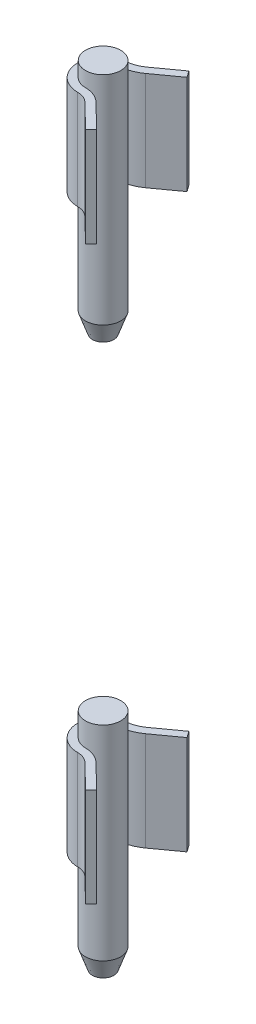
ISO-10303-21;
HEADER;
FILE_DESCRIPTION(('STEP AP214'),'2;1');
FILE_NAME('part.step','',(''),(''),'','','');
FILE_SCHEMA(('AUTOMOTIVE_DESIGN { 1 0 10303 214 1 1 1 1 }'));
ENDSEC;
DATA;
#1=APPLICATION_CONTEXT('core data for automotive mechanical design processes');
#2=APPLICATION_PROTOCOL_DEFINITION('international standard','automotive_design',2000,#1);
#3=PRODUCT_CONTEXT('',#1,'mechanical');
#4=PRODUCT('Part','Part','',(#3));
#5=PRODUCT_RELATED_PRODUCT_CATEGORY('part','',(#4));
#6=PRODUCT_DEFINITION_FORMATION('','',#4);
#7=PRODUCT_DEFINITION_CONTEXT('part definition',#1,'design');
#8=PRODUCT_DEFINITION('design','',#6,#7);
#9=PRODUCT_DEFINITION_SHAPE('','',#8);
#10=(LENGTH_UNIT() NAMED_UNIT(*) SI_UNIT(.MILLI.,.METRE.));
#11=(NAMED_UNIT(*) PLANE_ANGLE_UNIT() SI_UNIT($,.RADIAN.));
#12=(NAMED_UNIT(*) SI_UNIT($,.STERADIAN.) SOLID_ANGLE_UNIT());
#13=UNCERTAINTY_MEASURE_WITH_UNIT(LENGTH_MEASURE(1.E-05),#10,'distance_accuracy_value','');
#14=(GEOMETRIC_REPRESENTATION_CONTEXT(3) GLOBAL_UNCERTAINTY_ASSIGNED_CONTEXT((#13)) GLOBAL_UNIT_ASSIGNED_CONTEXT((#10,
#11,#12)) REPRESENTATION_CONTEXT('',''));
#15=CARTESIAN_POINT('',(0.,0.,0.));
#16=DIRECTION('',(0.,0.,1.));
#17=DIRECTION('',(1.,0.,0.));
#18=AXIS2_PLACEMENT_3D('',#15,#16,#17);
#19=CARTESIAN_POINT('',(0.,201.1,0.));
#20=DIRECTION('',(0.,-1.,0.));
#21=DIRECTION('',(0.,0.,-1.));
#22=AXIS2_PLACEMENT_3D('',#19,#20,#21);
#23=CYLINDRICAL_SURFACE('',#22,4.5);
#24=DIRECTION('',(0.,-1.,0.));
#25=VECTOR('',#24,1.);
#26=CARTESIAN_POINT('',(-0.420073756125089,197.3,-4.48035021392468));
#27=LINE('',#26,#25);
#28=CARTESIAN_POINT('',(-0.42007375612509,197.3,-4.48035021392468));
#29=VERTEX_POINT('',#28);
#30=CARTESIAN_POINT('',(-0.42007375612509,172.,-4.48035021392468));
#31=VERTEX_POINT('',#30);
#32=EDGE_CURVE('E69',#29,#31,#27,.T.);
#33=ORIENTED_EDGE('',*,*,#32,.F.);
#34=CARTESIAN_POINT('',(0.,197.3,0.));
#35=DIRECTION('',(0.,1.,0.));
#36=DIRECTION('',(0.,0.,-1.));
#37=AXIS2_PLACEMENT_3D('',#34,#35,#36);
#38=CIRCLE('',#37,4.5);
#39=CARTESIAN_POINT('',(0.,197.3,4.5));
#40=VERTEX_POINT('',#39);
#41=EDGE_CURVE('E64',#29,#40,#38,.T.);
#42=ORIENTED_EDGE('',*,*,#41,.T.);
#43=DIRECTION('',(0.,-1.,0.));
#44=VECTOR('',#43,1.);
#45=CARTESIAN_POINT('',(0.,197.3,4.5));
#46=LINE('',#45,#44);
#47=CARTESIAN_POINT('',(0.,172.,4.5));
#48=VERTEX_POINT('',#47);
#49=EDGE_CURVE('E225',#40,#48,#46,.T.);
#50=ORIENTED_EDGE('',*,*,#49,.T.);
#51=CARTESIAN_POINT('',(0.,172.,0.));
#52=DIRECTION('',(0.,1.,0.));
#53=DIRECTION('',(0.,0.,-1.));
#54=AXIS2_PLACEMENT_3D('',#51,#52,#53);
#55=CIRCLE('',#54,4.5);
#56=EDGE_CURVE('E217',#31,#48,#55,.T.);
#57=ORIENTED_EDGE('',*,*,#56,.F.);
#58=EDGE_LOOP('',(#33,#42,#50,#57));
#59=FACE_BOUND('',#58,.T.);
#60=CARTESIAN_POINT('',(0.,201.1,0.));
#61=DIRECTION('',(0.,1.,0.));
#62=DIRECTION('',(0.,0.,1.));
#63=AXIS2_PLACEMENT_3D('',#60,#61,#62);
#64=CIRCLE('',#63,4.5);
#65=CARTESIAN_POINT('',(0.,201.1,4.5));
#66=VERTEX_POINT('',#65);
#67=EDGE_CURVE('E12',#66,#66,#64,.T.);
#68=ORIENTED_EDGE('',*,*,#67,.F.);
#69=EDGE_LOOP('',(#68));
#70=FACE_BOUND('',#69,.T.);
#71=CARTESIAN_POINT('',(0.,145.7,0.));
#72=DIRECTION('',(0.,1.,0.));
#73=DIRECTION('',(0.,0.,1.));
#74=AXIS2_PLACEMENT_3D('',#71,#72,#73);
#75=CIRCLE('',#74,4.5);
#76=CARTESIAN_POINT('',(0.,145.7,4.5));
#77=VERTEX_POINT('',#76);
#78=EDGE_CURVE('E458',#77,#77,#75,.T.);
#79=ORIENTED_EDGE('',*,*,#78,.T.);
#80=EDGE_LOOP('',(#79));
#81=FACE_BOUND('',#80,.T.);
#82=ADVANCED_FACE('F50',(#59,#70,#81),#23,.T.);
#83=CARTESIAN_POINT('',(0.,201.1,0.));
#84=DIRECTION('',(0.,1.,0.));
#85=DIRECTION('',(0.,0.,1.));
#86=AXIS2_PLACEMENT_3D('',#83,#84,#85);
#87=PLANE('',#86);
#88=ORIENTED_EDGE('',*,*,#67,.T.);
#89=EDGE_LOOP('',(#88));
#90=FACE_BOUND('',#89,.T.);
#91=ADVANCED_FACE('F285',(#90),#87,.T.);
#92=CARTESIAN_POINT('',(9.27353574898046,197.3,13.7598368488019));
#93=DIRECTION('',(0.716874010789402,0.,0.697202734256483));
#94=DIRECTION('',(0.697202734256483,0.,-0.716874010789402));
#95=AXIS2_PLACEMENT_3D('',#92,#93,#94);
#96=PLANE('',#95);
#97=DIRECTION('',(-0.697202734256483,0.,0.716874010789402));
#98=VECTOR('',#97,1.);
#99=CARTESIAN_POINT('',(9.27353574898046,172.,13.7598368488019));
#100=LINE('',#99,#98);
#101=CARTESIAN_POINT('',(10.6679412174934,172.,12.3260888272231));
#102=VERTEX_POINT('',#101);
#103=CARTESIAN_POINT('',(9.27353574898046,172.,13.7598368488019));
#104=VERTEX_POINT('',#103);
#105=EDGE_CURVE('E193',#102,#104,#100,.T.);
#106=ORIENTED_EDGE('',*,*,#105,.F.);
#107=DIRECTION('',(0.,-1.,0.));
#108=VECTOR('',#107,1.);
#109=CARTESIAN_POINT('',(10.6679412174934,197.3,12.3260888272231));
#110=LINE('',#109,#108);
#111=CARTESIAN_POINT('',(10.6679412174934,197.3,12.3260888272231));
#112=VERTEX_POINT('',#111);
#113=EDGE_CURVE('E57',#112,#102,#110,.T.);
#114=ORIENTED_EDGE('',*,*,#113,.F.);
#115=DIRECTION('',(-0.697202734256483,0.,0.716874010789402));
#116=VECTOR('',#115,1.);
#117=CARTESIAN_POINT('',(9.27353574898046,197.3,13.7598368488019));
#118=LINE('',#117,#116);
#119=CARTESIAN_POINT('',(9.27353574898046,197.3,13.7598368488019));
#120=VERTEX_POINT('',#119);
#121=EDGE_CURVE('E153',#112,#120,#118,.T.);
#122=ORIENTED_EDGE('',*,*,#121,.T.);
#123=DIRECTION('',(0.,-1.,0.));
#124=VECTOR('',#123,1.);
#125=CARTESIAN_POINT('',(9.27353574898046,197.3,13.7598368488019));
#126=LINE('',#125,#124);
#127=EDGE_CURVE('E136',#120,#104,#126,.T.);
#128=ORIENTED_EDGE('',*,*,#127,.T.);
#129=EDGE_LOOP('',(#106,#114,#122,#128));
#130=FACE_BOUND('',#129,.T.);
#131=ADVANCED_FACE('F159',(#130),#96,.T.);
#132=CARTESIAN_POINT('',(10.6679412174934,197.3,12.3260888272231));
#133=DIRECTION('',(0.697202734256483,0.,-0.716874010789402));
#134=DIRECTION('',(-0.716874010789402,0.,-0.697202734256483));
#135=AXIS2_PLACEMENT_3D('',#132,#133,#134);
#136=PLANE('',#135);
#137=DIRECTION('',(0.716874010789402,0.,0.697202734256483));
#138=VECTOR('',#137,1.);
#139=CARTESIAN_POINT('',(10.6679412174934,172.,12.3260888272231));
#140=LINE('',#139,#138);
#141=CARTESIAN_POINT('',(4.5,172.,6.32739809935827));
#142=VERTEX_POINT('',#141);
#143=EDGE_CURVE('E160',#142,#102,#140,.T.);
#144=ORIENTED_EDGE('',*,*,#143,.F.);
#145=DIRECTION('',(0.,-1.,0.));
#146=VECTOR('',#145,1.);
#147=CARTESIAN_POINT('',(4.5,197.3,6.32739809935827));
#148=LINE('',#147,#146);
#149=CARTESIAN_POINT('',(4.5,197.3,6.32739809935827));
#150=VERTEX_POINT('',#149);
#151=EDGE_CURVE('E223',#150,#142,#148,.T.);
#152=ORIENTED_EDGE('',*,*,#151,.F.);
#153=DIRECTION('',(0.716874010789402,0.,0.697202734256483));
#154=VECTOR('',#153,1.);
#155=CARTESIAN_POINT('',(10.6679412174934,197.3,12.3260888272231));
#156=LINE('',#155,#154);
#157=EDGE_CURVE('E147',#150,#112,#156,.T.);
#158=ORIENTED_EDGE('',*,*,#157,.T.);
#159=ORIENTED_EDGE('',*,*,#113,.T.);
#160=EDGE_LOOP('',(#144,#152,#158,#159));
#161=FACE_BOUND('',#160,.T.);
#162=ADVANCED_FACE('F249',(#161),#136,.T.);
#163=CARTESIAN_POINT('',(0.,197.3,10.9543636719941));
#164=DIRECTION('',(0.,-1.,0.));
#165=DIRECTION('',(0.,0.,-1.));
#166=AXIS2_PLACEMENT_3D('',#163,#164,#165);
#167=CYLINDRICAL_SURFACE('',#166,6.45436367199409);
#168=CARTESIAN_POINT('',(0.,172.,10.9543636719941));
#169=DIRECTION('',(0.,-1.,0.));
#170=DIRECTION('',(0.,0.,1.));
#171=AXIS2_PLACEMENT_3D('',#168,#169,#170);
#172=CIRCLE('',#171,6.45436367199409);
#173=EDGE_CURVE('E163',#48,#142,#172,.T.);
#174=ORIENTED_EDGE('',*,*,#173,.F.);
#175=ORIENTED_EDGE('',*,*,#49,.F.);
#176=CARTESIAN_POINT('',(0.,197.3,10.9543636719941));
#177=DIRECTION('',(0.,-1.,0.));
#178=DIRECTION('',(0.,0.,1.));
#179=AXIS2_PLACEMENT_3D('',#176,#177,#178);
#180=CIRCLE('',#179,6.45436367199409);
#181=EDGE_CURVE('E189',#40,#150,#180,.T.);
#182=ORIENTED_EDGE('',*,*,#181,.T.);
#183=ORIENTED_EDGE('',*,*,#151,.T.);
#184=EDGE_LOOP('',(#174,#175,#182,#183));
#185=FACE_BOUND('',#184,.T.);
#186=ADVANCED_FACE('F253',(#185),#167,.T.);
#187=CARTESIAN_POINT('',(-1.35441036251559,197.3,-14.4456364363584));
#188=DIRECTION('',(0.,-1.,0.));
#189=DIRECTION('',(0.,0.,-1.));
#190=AXIS2_PLACEMENT_3D('',#187,#188,#189);
#191=CYLINDRICAL_SURFACE('',#190,10.0089916769407);
#192=CARTESIAN_POINT('',(-1.35441036251559,172.,-14.4456364363584));
#193=DIRECTION('',(0.,-1.,0.));
#194=DIRECTION('',(0.,0.,-1.));
#195=AXIS2_PLACEMENT_3D('',#192,#193,#194);
#196=CIRCLE('',#195,10.0089916769407);
#197=CARTESIAN_POINT('',(4.5,172.,-6.32739809935828));
#198=VERTEX_POINT('',#197);
#199=EDGE_CURVE('E214',#198,#31,#196,.T.);
#200=ORIENTED_EDGE('',*,*,#199,.F.);
#201=DIRECTION('',(0.,-1.,0.));
#202=VECTOR('',#201,1.);
#203=CARTESIAN_POINT('',(4.5,197.3,-6.32739809935828));
#204=LINE('',#203,#202);
#205=CARTESIAN_POINT('',(4.5,197.3,-6.32739809935828));
#206=VERTEX_POINT('',#205);
#207=EDGE_CURVE('E228',#206,#198,#204,.T.);
#208=ORIENTED_EDGE('',*,*,#207,.F.);
#209=CARTESIAN_POINT('',(-1.35441036251559,197.3,-14.4456364363584));
#210=DIRECTION('',(0.,-1.,0.));
#211=DIRECTION('',(0.,0.,-1.));
#212=AXIS2_PLACEMENT_3D('',#209,#210,#211);
#213=CIRCLE('',#212,10.0089916769407);
#214=EDGE_CURVE('E185',#206,#29,#213,.T.);
#215=ORIENTED_EDGE('',*,*,#214,.T.);
#216=ORIENTED_EDGE('',*,*,#32,.T.);
#217=EDGE_LOOP('',(#200,#208,#215,#216));
#218=FACE_BOUND('',#217,.T.);
#219=ADVANCED_FACE('F257',(#218),#191,.T.);
#220=CARTESIAN_POINT('',(10.6679412174934,197.3,-10.7753654390834));
#221=DIRECTION('',(0.584915099490324,0.,0.811094523707456));
#222=DIRECTION('',(0.811094523707456,0.,-0.584915099490324));
#223=AXIS2_PLACEMENT_3D('',#220,#221,#222);
#224=PLANE('',#223);
#225=DIRECTION('',(-0.811094523707456,0.,0.584915099490324));
#226=VECTOR('',#225,1.);
#227=CARTESIAN_POINT('',(10.6679412174934,172.,-10.7753654390834));
#228=LINE('',#227,#226);
#229=CARTESIAN_POINT('',(10.6679412174934,172.,-10.7753654390834));
#230=VERTEX_POINT('',#229);
#231=EDGE_CURVE('E211',#230,#198,#228,.T.);
#232=ORIENTED_EDGE('',*,*,#231,.F.);
#233=DIRECTION('',(0.,-1.,0.));
#234=VECTOR('',#233,1.);
#235=CARTESIAN_POINT('',(10.6679412174934,197.3,-10.7753654390834));
#236=LINE('',#235,#234);
#237=CARTESIAN_POINT('',(10.6679412174934,197.3,-10.7753654390834));
#238=VERTEX_POINT('',#237);
#239=EDGE_CURVE('E230',#238,#230,#236,.T.);
#240=ORIENTED_EDGE('',*,*,#239,.F.);
#241=DIRECTION('',(-0.811094523707456,0.,0.584915099490324));
#242=VECTOR('',#241,1.);
#243=CARTESIAN_POINT('',(10.6679412174934,197.3,-10.7753654390834));
#244=LINE('',#243,#242);
#245=EDGE_CURVE('E182',#238,#206,#244,.T.);
#246=ORIENTED_EDGE('',*,*,#245,.T.);
#247=ORIENTED_EDGE('',*,*,#207,.T.);
#248=EDGE_LOOP('',(#232,#240,#246,#247));
#249=FACE_BOUND('',#248,.T.);
#250=ADVANCED_FACE('F261',(#249),#224,.T.);
#251=CARTESIAN_POINT('',(9.49811101851278,197.3,-12.3975544864983));
#252=DIRECTION('',(0.811094523707455,0.,-0.584915099490324));
#253=DIRECTION('',(-0.584915099490324,0.,-0.811094523707455));
#254=AXIS2_PLACEMENT_3D('',#251,#252,#253);
#255=PLANE('',#254);
#256=DIRECTION('',(0.584915099490324,0.,0.811094523707455));
#257=VECTOR('',#256,1.);
#258=CARTESIAN_POINT('',(9.49811101851278,172.,-12.3975544864983));
#259=LINE('',#258,#257);
#260=CARTESIAN_POINT('',(9.49811101851278,172.,-12.3975544864983));
#261=VERTEX_POINT('',#260);
#262=EDGE_CURVE('E208',#261,#230,#259,.T.);
#263=ORIENTED_EDGE('',*,*,#262,.F.);
#264=DIRECTION('',(0.,-1.,0.));
#265=VECTOR('',#264,1.);
#266=CARTESIAN_POINT('',(9.49811101851278,197.3,-12.3975544864983));
#267=LINE('',#266,#265);
#268=CARTESIAN_POINT('',(9.49811101851278,197.3,-12.3975544864983));
#269=VERTEX_POINT('',#268);
#270=EDGE_CURVE('E232',#269,#261,#267,.T.);
#271=ORIENTED_EDGE('',*,*,#270,.F.);
#272=DIRECTION('',(0.584915099490324,0.,0.811094523707455));
#273=VECTOR('',#272,1.);
#274=CARTESIAN_POINT('',(9.49811101851278,197.3,-12.3975544864983));
#275=LINE('',#274,#273);
#276=EDGE_CURVE('E179',#269,#238,#275,.T.);
#277=ORIENTED_EDGE('',*,*,#276,.T.);
#278=ORIENTED_EDGE('',*,*,#239,.T.);
#279=EDGE_LOOP('',(#263,#271,#277,#278));
#280=FACE_BOUND('',#279,.T.);
#281=ADVANCED_FACE('F266',(#280),#255,.T.);
#282=CARTESIAN_POINT('',(3.33016980101935,197.3,-7.94958714677318));
#283=DIRECTION('',(-0.584915099490324,0.,-0.811094523707456));
#284=DIRECTION('',(-0.811094523707456,0.,0.584915099490324));
#285=AXIS2_PLACEMENT_3D('',#282,#283,#284);
#286=PLANE('',#285);
#287=DIRECTION('',(0.811094523707456,0.,-0.584915099490324));
#288=VECTOR('',#287,1.);
#289=CARTESIAN_POINT('',(3.33016980101935,172.,-7.94958714677318));
#290=LINE('',#289,#288);
#291=CARTESIAN_POINT('',(3.33016980101935,172.,-7.94958714677318));
#292=VERTEX_POINT('',#291);
#293=EDGE_CURVE('E205',#292,#261,#290,.T.);
#294=ORIENTED_EDGE('',*,*,#293,.F.);
#295=DIRECTION('',(0.,-1.,0.));
#296=VECTOR('',#295,1.);
#297=CARTESIAN_POINT('',(3.33016980101935,197.3,-7.94958714677318));
#298=LINE('',#297,#296);
#299=CARTESIAN_POINT('',(3.33016980101935,197.3,-7.94958714677318));
#300=VERTEX_POINT('',#299);
#301=EDGE_CURVE('E234',#300,#292,#298,.T.);
#302=ORIENTED_EDGE('',*,*,#301,.F.);
#303=DIRECTION('',(0.811094523707456,0.,-0.584915099490324));
#304=VECTOR('',#303,1.);
#305=CARTESIAN_POINT('',(3.33016980101935,197.3,-7.94958714677318));
#306=LINE('',#305,#304);
#307=EDGE_CURVE('E176',#300,#269,#306,.T.);
#308=ORIENTED_EDGE('',*,*,#307,.T.);
#309=ORIENTED_EDGE('',*,*,#270,.T.);
#310=EDGE_LOOP('',(#294,#302,#308,#309));
#311=FACE_BOUND('',#310,.T.);
#312=ADVANCED_FACE('F269',(#311),#286,.T.);
#313=CARTESIAN_POINT('',(-1.35441036251559,197.3,-14.4456364363584));
#314=DIRECTION('',(0.,-1.,0.));
#315=DIRECTION('',(0.,0.,-1.));
#316=AXIS2_PLACEMENT_3D('',#313,#314,#315);
#317=CYLINDRICAL_SURFACE('',#316,8.00899167694069);
#318=CARTESIAN_POINT('',(-1.35441036251559,172.,-14.4456364363584));
#319=DIRECTION('',(0.,1.,0.));
#320=DIRECTION('',(0.,0.,1.));
#321=AXIS2_PLACEMENT_3D('',#318,#319,#320);
#322=CIRCLE('',#321,8.00899167694069);
#323=CARTESIAN_POINT('',(-0.606773203291796,172.,-6.47161697566899));
#324=VERTEX_POINT('',#323);
#325=EDGE_CURVE('E202',#324,#292,#322,.T.);
#326=ORIENTED_EDGE('',*,*,#325,.F.);
#327=DIRECTION('',(0.,-1.,0.));
#328=VECTOR('',#327,1.);
#329=CARTESIAN_POINT('',(-0.606773203291796,197.3,-6.47161697566899));
#330=LINE('',#329,#328);
#331=CARTESIAN_POINT('',(-0.606773203291796,197.3,-6.47161697566899));
#332=VERTEX_POINT('',#331);
#333=EDGE_CURVE('E236',#332,#324,#330,.T.);
#334=ORIENTED_EDGE('',*,*,#333,.F.);
#335=CARTESIAN_POINT('',(-1.35441036251559,197.3,-14.4456364363584));
#336=DIRECTION('',(0.,1.,0.));
#337=DIRECTION('',(0.,0.,1.));
#338=AXIS2_PLACEMENT_3D('',#335,#336,#337);
#339=CIRCLE('',#338,8.00899167694069);
#340=EDGE_CURVE('E173',#332,#300,#339,.T.);
#341=ORIENTED_EDGE('',*,*,#340,.T.);
#342=ORIENTED_EDGE('',*,*,#301,.T.);
#343=EDGE_LOOP('',(#326,#334,#341,#342));
#344=FACE_BOUND('',#343,.T.);
#345=ADVANCED_FACE('F273',(#344),#317,.F.);
#346=CARTESIAN_POINT('',(0.,197.3,0.));
#347=DIRECTION('',(0.,-1.,0.));
#348=DIRECTION('',(0.,0.,-1.));
#349=AXIS2_PLACEMENT_3D('',#346,#347,#348);
#350=CYLINDRICAL_SURFACE('',#349,6.5);
#351=CARTESIAN_POINT('',(0.,172.,0.));
#352=DIRECTION('',(0.,-1.,0.));
#353=DIRECTION('',(0.,0.,-1.));
#354=AXIS2_PLACEMENT_3D('',#351,#352,#353);
#355=CIRCLE('',#354,6.5);
#356=CARTESIAN_POINT('',(0.,172.,6.5));
#357=VERTEX_POINT('',#356);
#358=EDGE_CURVE('E199',#357,#324,#355,.T.);
#359=ORIENTED_EDGE('',*,*,#358,.F.);
#360=DIRECTION('',(0.,-1.,0.));
#361=VECTOR('',#360,1.);
#362=CARTESIAN_POINT('',(0.,197.3,6.5));
#363=LINE('',#362,#361);
#364=CARTESIAN_POINT('',(0.,197.3,6.5));
#365=VERTEX_POINT('',#364);
#366=EDGE_CURVE('E238',#365,#357,#363,.T.);
#367=ORIENTED_EDGE('',*,*,#366,.F.);
#368=CARTESIAN_POINT('',(0.,197.3,0.));
#369=DIRECTION('',(0.,-1.,0.));
#370=DIRECTION('',(0.,0.,-1.));
#371=AXIS2_PLACEMENT_3D('',#368,#369,#370);
#372=CIRCLE('',#371,6.5);
#373=EDGE_CURVE('E170',#365,#332,#372,.T.);
#374=ORIENTED_EDGE('',*,*,#373,.T.);
#375=ORIENTED_EDGE('',*,*,#333,.T.);
#376=EDGE_LOOP('',(#359,#367,#374,#375));
#377=FACE_BOUND('',#376,.T.);
#378=ADVANCED_FACE('F275',(#377),#350,.T.);
#379=CARTESIAN_POINT('',(0.,197.3,10.9543636719941));
#380=DIRECTION('',(0.,-1.,0.));
#381=DIRECTION('',(0.,0.,-1.));
#382=AXIS2_PLACEMENT_3D('',#379,#380,#381);
#383=CYLINDRICAL_SURFACE('',#382,4.45436367199409);
#384=CARTESIAN_POINT('',(0.,172.,10.9543636719941));
#385=DIRECTION('',(0.,1.,0.));
#386=DIRECTION('',(0.,0.,1.));
#387=AXIS2_PLACEMENT_3D('',#384,#385,#386);
#388=CIRCLE('',#387,4.45436367199409);
#389=CARTESIAN_POINT('',(3.10559453148703,172.,7.76114612093708));
#390=VERTEX_POINT('',#389);
#391=EDGE_CURVE('E196',#390,#357,#388,.T.);
#392=ORIENTED_EDGE('',*,*,#391,.F.);
#393=DIRECTION('',(0.,-1.,0.));
#394=VECTOR('',#393,1.);
#395=CARTESIAN_POINT('',(3.10559453148703,197.3,7.76114612093708));
#396=LINE('',#395,#394);
#397=CARTESIAN_POINT('',(3.10559453148703,197.3,7.76114612093708));
#398=VERTEX_POINT('',#397);
#399=EDGE_CURVE('E146',#398,#390,#396,.T.);
#400=ORIENTED_EDGE('',*,*,#399,.F.);
#401=CARTESIAN_POINT('',(0.,197.3,10.9543636719941));
#402=DIRECTION('',(0.,1.,0.));
#403=DIRECTION('',(0.,0.,1.));
#404=AXIS2_PLACEMENT_3D('',#401,#402,#403);
#405=CIRCLE('',#404,4.45436367199409);
#406=EDGE_CURVE('E157',#398,#365,#405,.T.);
#407=ORIENTED_EDGE('',*,*,#406,.T.);
#408=ORIENTED_EDGE('',*,*,#366,.T.);
#409=EDGE_LOOP('',(#392,#400,#407,#408));
#410=FACE_BOUND('',#409,.T.);
#411=ADVANCED_FACE('F242',(#410),#383,.F.);
#412=CARTESIAN_POINT('',(9.27353574898046,197.3,13.7598368488019));
#413=DIRECTION('',(-0.697202734256483,0.,0.716874010789402));
#414=DIRECTION('',(0.716874010789402,0.,0.697202734256483));
#415=AXIS2_PLACEMENT_3D('',#412,#413,#414);
#416=PLANE('',#415);
#417=DIRECTION('',(-0.716874010789402,0.,-0.697202734256483));
#418=VECTOR('',#417,1.);
#419=CARTESIAN_POINT('',(9.27353574898046,172.,13.7598368488019));
#420=LINE('',#419,#418);
#421=EDGE_CURVE('E141',#104,#390,#420,.T.);
#422=ORIENTED_EDGE('',*,*,#421,.F.);
#423=ORIENTED_EDGE('',*,*,#127,.F.);
#424=DIRECTION('',(-0.716874010789402,0.,-0.697202734256483));
#425=VECTOR('',#424,1.);
#426=CARTESIAN_POINT('',(9.27353574898046,197.3,13.7598368488019));
#427=LINE('',#426,#425);
#428=EDGE_CURVE('E139',#120,#398,#427,.T.);
#429=ORIENTED_EDGE('',*,*,#428,.T.);
#430=ORIENTED_EDGE('',*,*,#399,.T.);
#431=EDGE_LOOP('',(#422,#423,#429,#430));
#432=FACE_BOUND('',#431,.T.);
#433=ADVANCED_FACE('F138',(#432),#416,.T.);
#434=CARTESIAN_POINT('',(0.,197.3,10.9543636719941));
#435=DIRECTION('',(0.,1.,0.));
#436=DIRECTION('',(0.,0.,1.));
#437=AXIS2_PLACEMENT_3D('',#434,#435,#436);
#438=PLANE('',#437);
#439=ORIENTED_EDGE('',*,*,#121,.F.);
#440=ORIENTED_EDGE('',*,*,#157,.F.);
#441=ORIENTED_EDGE('',*,*,#181,.F.);
#442=ORIENTED_EDGE('',*,*,#41,.F.);
#443=ORIENTED_EDGE('',*,*,#214,.F.);
#444=ORIENTED_EDGE('',*,*,#245,.F.);
#445=ORIENTED_EDGE('',*,*,#276,.F.);
#446=ORIENTED_EDGE('',*,*,#307,.F.);
#447=ORIENTED_EDGE('',*,*,#340,.F.);
#448=ORIENTED_EDGE('',*,*,#373,.F.);
#449=ORIENTED_EDGE('',*,*,#406,.F.);
#450=ORIENTED_EDGE('',*,*,#428,.F.);
#451=EDGE_LOOP('',(#439,#440,#441,#442,#443,#444,#445,#446,#447,#448,#449,#450));
#452=FACE_BOUND('',#451,.T.);
#453=ADVANCED_FACE('F151',(#452),#438,.T.);
#454=CARTESIAN_POINT('',(0.,172.,10.9543636719941));
#455=DIRECTION('',(0.,1.,0.));
#456=DIRECTION('',(0.,0.,1.));
#457=AXIS2_PLACEMENT_3D('',#454,#455,#456);
#458=PLANE('',#457);
#459=ORIENTED_EDGE('',*,*,#105,.T.);
#460=ORIENTED_EDGE('',*,*,#421,.T.);
#461=ORIENTED_EDGE('',*,*,#391,.T.);
#462=ORIENTED_EDGE('',*,*,#358,.T.);
#463=ORIENTED_EDGE('',*,*,#325,.T.);
#464=ORIENTED_EDGE('',*,*,#293,.T.);
#465=ORIENTED_EDGE('',*,*,#262,.T.);
#466=ORIENTED_EDGE('',*,*,#231,.T.);
#467=ORIENTED_EDGE('',*,*,#199,.T.);
#468=ORIENTED_EDGE('',*,*,#56,.T.);
#469=ORIENTED_EDGE('',*,*,#173,.T.);
#470=ORIENTED_EDGE('',*,*,#143,.T.);
#471=EDGE_LOOP('',(#459,#460,#461,#462,#463,#464,#465,#466,#467,#468,#469,#470));
#472=FACE_BOUND('',#471,.T.);
#473=ADVANCED_FACE('F245',(#472),#458,.F.);
#474=CARTESIAN_POINT('',(0.,140.7,2.74999999999999));
#475=DIRECTION('',(0.,-1.,0.));
#476=DIRECTION('',(0.,0.,-1.));
#477=AXIS2_PLACEMENT_3D('',#474,#475,#476);
#478=PLANE('',#477);
#479=CARTESIAN_POINT('',(0.,140.7,0.));
#480=DIRECTION('',(0.,1.,0.));
#481=DIRECTION('',(0.,0.,1.));
#482=AXIS2_PLACEMENT_3D('',#479,#480,#481);
#483=CIRCLE('',#482,2.74999999999999);
#484=CARTESIAN_POINT('',(0.,140.7,2.74999999999999));
#485=VERTEX_POINT('',#484);
#486=EDGE_CURVE('E166',#485,#485,#483,.T.);
#487=ORIENTED_EDGE('',*,*,#486,.F.);
#488=EDGE_LOOP('',(#487));
#489=FACE_BOUND('',#488,.T.);
#490=ADVANCED_FACE('F303',(#489),#478,.T.);
#491=CARTESIAN_POINT('',(0.,145.7,0.));
#492=DIRECTION('',(0.,1.,0.));
#493=DIRECTION('',(0.,0.,1.));
#494=AXIS2_PLACEMENT_3D('',#491,#492,#493);
#495=CONICAL_SURFACE('',#494,4.5,0.336674819386724);
#496=ORIENTED_EDGE('',*,*,#486,.T.);
#497=EDGE_LOOP('',(#496));
#498=FACE_BOUND('',#497,.T.);
#499=ORIENTED_EDGE('',*,*,#78,.F.);
#500=EDGE_LOOP('',(#499));
#501=FACE_BOUND('',#500,.T.);
#502=ADVANCED_FACE('F371',(#498,#501),#495,.T.);
#503=CLOSED_SHELL('',(#82,#91,#131,#162,#186,#219,#250,#281,#312,#345,#378,#411,#433,#453,#473,
#490,#502));
#504=MANIFOLD_SOLID_BREP('B2',#503);
#505=CARTESIAN_POINT('',(0.,55.,0.));
#506=DIRECTION('',(0.,-1.,0.));
#507=DIRECTION('',(0.,0.,-1.));
#508=AXIS2_PLACEMENT_3D('',#505,#506,#507);
#509=CYLINDRICAL_SURFACE('',#508,4.5);
#510=DIRECTION('',(0.,-1.,0.));
#511=VECTOR('',#510,1.);
#512=CARTESIAN_POINT('',(-0.420073756125089,51.2,-4.48035021392468));
#513=LINE('',#512,#511);
#514=CARTESIAN_POINT('',(-0.42007375612509,51.2,-4.48035021392468));
#515=VERTEX_POINT('',#514);
#516=CARTESIAN_POINT('',(-0.42007375612509,25.9,-4.48035021392468));
#517=VERTEX_POINT('',#516);
#518=EDGE_CURVE('E484',#515,#517,#513,.T.);
#519=ORIENTED_EDGE('',*,*,#518,.F.);
#520=CARTESIAN_POINT('',(0.,51.2,0.));
#521=DIRECTION('',(0.,1.,0.));
#522=DIRECTION('',(0.,0.,-1.));
#523=AXIS2_PLACEMENT_3D('',#520,#521,#522);
#524=CIRCLE('',#523,4.5);
#525=CARTESIAN_POINT('',(0.,51.2,4.5));
#526=VERTEX_POINT('',#525);
#527=EDGE_CURVE('E479',#515,#526,#524,.T.);
#528=ORIENTED_EDGE('',*,*,#527,.T.);
#529=DIRECTION('',(0.,-1.,0.));
#530=VECTOR('',#529,1.);
#531=CARTESIAN_POINT('',(0.,51.2,4.5));
#532=LINE('',#531,#530);
#533=CARTESIAN_POINT('',(0.,25.9,4.5));
#534=VERTEX_POINT('',#533);
#535=EDGE_CURVE('E641',#526,#534,#532,.T.);
#536=ORIENTED_EDGE('',*,*,#535,.T.);
#537=CARTESIAN_POINT('',(0.,25.9,0.));
#538=DIRECTION('',(0.,1.,0.));
#539=DIRECTION('',(0.,0.,-1.));
#540=AXIS2_PLACEMENT_3D('',#537,#538,#539);
#541=CIRCLE('',#540,4.5);
#542=EDGE_CURVE('E633',#517,#534,#541,.T.);
#543=ORIENTED_EDGE('',*,*,#542,.F.);
#544=EDGE_LOOP('',(#519,#528,#536,#543));
#545=FACE_BOUND('',#544,.T.);
#546=CARTESIAN_POINT('',(0.,5.00000000000007,0.));
#547=DIRECTION('',(0.,1.,0.));
#548=DIRECTION('',(0.,0.,1.));
#549=AXIS2_PLACEMENT_3D('',#546,#547,#548);
#550=CIRCLE('',#549,4.5);
#551=CARTESIAN_POINT('',(0.,5.00000000000007,4.5));
#552=VERTEX_POINT('',#551);
#553=EDGE_CURVE('E472',#552,#552,#550,.T.);
#554=ORIENTED_EDGE('',*,*,#553,.T.);
#555=EDGE_LOOP('',(#554));
#556=FACE_BOUND('',#555,.T.);
#557=CARTESIAN_POINT('',(0.,57.2,0.));
#558=DIRECTION('',(0.,1.,0.));
#559=DIRECTION('',(0.,0.,1.));
#560=AXIS2_PLACEMENT_3D('',#557,#558,#559);
#561=CIRCLE('',#560,4.5);
#562=CARTESIAN_POINT('',(0.,57.2,4.5));
#563=VERTEX_POINT('',#562);
#564=EDGE_CURVE('E583',#563,#563,#561,.T.);
#565=ORIENTED_EDGE('',*,*,#564,.F.);
#566=EDGE_LOOP('',(#565));
#567=FACE_BOUND('',#566,.T.);
#568=ADVANCED_FACE('F463',(#545,#556,#567),#509,.T.);
#569=CARTESIAN_POINT('',(0.,0.,0.));
#570=DIRECTION('',(0.,1.,0.));
#571=DIRECTION('',(0.,0.,1.));
#572=AXIS2_PLACEMENT_3D('',#569,#570,#571);
#573=PLANE('',#572);
#574=CARTESIAN_POINT('',(0.,0.,0.));
#575=DIRECTION('',(0.,1.,0.));
#576=DIRECTION('',(0.,0.,1.));
#577=AXIS2_PLACEMENT_3D('',#574,#575,#576);
#578=CIRCLE('',#577,2.74999999999999);
#579=CARTESIAN_POINT('',(0.,0.,2.74999999999999));
#580=VERTEX_POINT('',#579);
#581=EDGE_CURVE('E48',#580,#580,#578,.F.);
#582=ORIENTED_EDGE('',*,*,#581,.T.);
#583=EDGE_LOOP('',(#582));
#584=FACE_BOUND('',#583,.T.);
#585=ADVANCED_FACE('F662',(#584),#573,.F.);
#586=CARTESIAN_POINT('',(0.,5.00000000000007,0.));
#587=DIRECTION('',(0.,1.,0.));
#588=DIRECTION('',(0.,0.,1.));
#589=AXIS2_PLACEMENT_3D('',#586,#587,#588);
#590=CONICAL_SURFACE('',#589,4.5,0.336674819386724);
#591=ORIENTED_EDGE('',*,*,#581,.F.);
#592=EDGE_LOOP('',(#591));
#593=FACE_BOUND('',#592,.T.);
#594=ORIENTED_EDGE('',*,*,#553,.F.);
#595=EDGE_LOOP('',(#594));
#596=FACE_BOUND('',#595,.T.);
#597=ADVANCED_FACE('F466',(#593,#596),#590,.T.);
#598=CARTESIAN_POINT('',(9.27353574898046,51.2,13.7598368488019));
#599=DIRECTION('',(0.716874010789402,0.,0.697202734256483));
#600=DIRECTION('',(0.697202734256483,0.,-0.716874010789402));
#601=AXIS2_PLACEMENT_3D('',#598,#599,#600);
#602=PLANE('',#601);
#603=DIRECTION('',(-0.697202734256483,0.,0.716874010789402));
#604=VECTOR('',#603,1.);
#605=CARTESIAN_POINT('',(9.27353574898046,25.9,13.7598368488019));
#606=LINE('',#605,#604);
#607=CARTESIAN_POINT('',(10.6679412174934,25.9,12.3260888272231));
#608=VERTEX_POINT('',#607);
#609=CARTESIAN_POINT('',(9.27353574898046,25.9,13.7598368488019));
#610=VERTEX_POINT('',#609);
#611=EDGE_CURVE('E609',#608,#610,#606,.T.);
#612=ORIENTED_EDGE('',*,*,#611,.F.);
#613=DIRECTION('',(0.,-1.,0.));
#614=VECTOR('',#613,1.);
#615=CARTESIAN_POINT('',(10.6679412174934,51.2,12.3260888272231));
#616=LINE('',#615,#614);
#617=CARTESIAN_POINT('',(10.6679412174934,51.2,12.3260888272231));
#618=VERTEX_POINT('',#617);
#619=EDGE_CURVE('E576',#618,#608,#616,.T.);
#620=ORIENTED_EDGE('',*,*,#619,.F.);
#621=DIRECTION('',(-0.697202734256483,0.,0.716874010789402));
#622=VECTOR('',#621,1.);
#623=CARTESIAN_POINT('',(9.27353574898046,51.2,13.7598368488019));
#624=LINE('',#623,#622);
#625=CARTESIAN_POINT('',(9.27353574898046,51.2,13.7598368488019));
#626=VERTEX_POINT('',#625);
#627=EDGE_CURVE('E569',#618,#626,#624,.T.);
#628=ORIENTED_EDGE('',*,*,#627,.T.);
#629=DIRECTION('',(0.,-1.,0.));
#630=VECTOR('',#629,1.);
#631=CARTESIAN_POINT('',(9.27353574898046,51.2,13.7598368488019));
#632=LINE('',#631,#630);
#633=EDGE_CURVE('E551',#626,#610,#632,.T.);
#634=ORIENTED_EDGE('',*,*,#633,.T.);
#635=EDGE_LOOP('',(#612,#620,#628,#634));
#636=FACE_BOUND('',#635,.T.);
#637=ADVANCED_FACE('F575',(#636),#602,.T.);
#638=CARTESIAN_POINT('',(10.6679412174934,51.2,12.3260888272231));
#639=DIRECTION('',(0.697202734256483,0.,-0.716874010789402));
#640=DIRECTION('',(-0.716874010789402,0.,-0.697202734256483));
#641=AXIS2_PLACEMENT_3D('',#638,#639,#640);
#642=PLANE('',#641);
#643=DIRECTION('',(0.716874010789402,0.,0.697202734256483));
#644=VECTOR('',#643,1.);
#645=CARTESIAN_POINT('',(10.6679412174934,25.9,12.3260888272231));
#646=LINE('',#645,#644);
#647=CARTESIAN_POINT('',(4.5,25.9,6.32739809935827));
#648=VERTEX_POINT('',#647);
#649=EDGE_CURVE('E577',#648,#608,#646,.T.);
#650=ORIENTED_EDGE('',*,*,#649,.F.);
#651=DIRECTION('',(0.,-1.,0.));
#652=VECTOR('',#651,1.);
#653=CARTESIAN_POINT('',(4.5,51.2,6.32739809935827));
#654=LINE('',#653,#652);
#655=CARTESIAN_POINT('',(4.5,51.2,6.32739809935827));
#656=VERTEX_POINT('',#655);
#657=EDGE_CURVE('E639',#656,#648,#654,.T.);
#658=ORIENTED_EDGE('',*,*,#657,.F.);
#659=DIRECTION('',(0.716874010789402,0.,0.697202734256483));
#660=VECTOR('',#659,1.);
#661=CARTESIAN_POINT('',(10.6679412174934,51.2,12.3260888272231));
#662=LINE('',#661,#660);
#663=EDGE_CURVE('E562',#656,#618,#662,.T.);
#664=ORIENTED_EDGE('',*,*,#663,.T.);
#665=ORIENTED_EDGE('',*,*,#619,.T.);
#666=EDGE_LOOP('',(#650,#658,#664,#665));
#667=FACE_BOUND('',#666,.T.);
#668=ADVANCED_FACE('F668',(#667),#642,.T.);
#669=CARTESIAN_POINT('',(0.,51.2,10.9543636719941));
#670=DIRECTION('',(0.,-1.,0.));
#671=DIRECTION('',(0.,0.,-1.));
#672=AXIS2_PLACEMENT_3D('',#669,#670,#671);
#673=CYLINDRICAL_SURFACE('',#672,6.45436367199409);
#674=CARTESIAN_POINT('',(0.,25.9,10.9543636719941));
#675=DIRECTION('',(0.,-1.,0.));
#676=DIRECTION('',(0.,0.,1.));
#677=AXIS2_PLACEMENT_3D('',#674,#675,#676);
#678=CIRCLE('',#677,6.45436367199409);
#679=EDGE_CURVE('E580',#534,#648,#678,.T.);
#680=ORIENTED_EDGE('',*,*,#679,.F.);
#681=ORIENTED_EDGE('',*,*,#535,.F.);
#682=CARTESIAN_POINT('',(0.,51.2,10.9543636719941));
#683=DIRECTION('',(0.,-1.,0.));
#684=DIRECTION('',(0.,0.,1.));
#685=AXIS2_PLACEMENT_3D('',#682,#683,#684);
#686=CIRCLE('',#685,6.45436367199409);
#687=EDGE_CURVE('E605',#526,#656,#686,.T.);
#688=ORIENTED_EDGE('',*,*,#687,.T.);
#689=ORIENTED_EDGE('',*,*,#657,.T.);
#690=EDGE_LOOP('',(#680,#681,#688,#689));
#691=FACE_BOUND('',#690,.T.);
#692=ADVANCED_FACE('F706',(#691),#673,.T.);
#693=CARTESIAN_POINT('',(-1.35441036251559,51.2,-14.4456364363584));
#694=DIRECTION('',(0.,-1.,0.));
#695=DIRECTION('',(0.,0.,-1.));
#696=AXIS2_PLACEMENT_3D('',#693,#694,#695);
#697=CYLINDRICAL_SURFACE('',#696,10.0089916769407);
#698=CARTESIAN_POINT('',(-1.35441036251559,25.9,-14.4456364363584));
#699=DIRECTION('',(0.,-1.,0.));
#700=DIRECTION('',(0.,0.,-1.));
#701=AXIS2_PLACEMENT_3D('',#698,#699,#700);
#702=CIRCLE('',#701,10.0089916769407);
#703=CARTESIAN_POINT('',(4.5,25.9,-6.32739809935828));
#704=VERTEX_POINT('',#703);
#705=EDGE_CURVE('E630',#704,#517,#702,.T.);
#706=ORIENTED_EDGE('',*,*,#705,.F.);
#707=DIRECTION('',(0.,-1.,0.));
#708=VECTOR('',#707,1.);
#709=CARTESIAN_POINT('',(4.5,51.2,-6.32739809935828));
#710=LINE('',#709,#708);
#711=CARTESIAN_POINT('',(4.5,51.2,-6.32739809935828));
#712=VERTEX_POINT('',#711);
#713=EDGE_CURVE('E644',#712,#704,#710,.T.);
#714=ORIENTED_EDGE('',*,*,#713,.F.);
#715=CARTESIAN_POINT('',(-1.35441036251559,51.2,-14.4456364363584));
#716=DIRECTION('',(0.,-1.,0.));
#717=DIRECTION('',(0.,0.,-1.));
#718=AXIS2_PLACEMENT_3D('',#715,#716,#717);
#719=CIRCLE('',#718,10.0089916769407);
#720=EDGE_CURVE('E601',#712,#515,#719,.T.);
#721=ORIENTED_EDGE('',*,*,#720,.T.);
#722=ORIENTED_EDGE('',*,*,#518,.T.);
#723=EDGE_LOOP('',(#706,#714,#721,#722));
#724=FACE_BOUND('',#723,.T.);
#725=ADVANCED_FACE('F702',(#724),#697,.T.);
#726=CARTESIAN_POINT('',(10.6679412174934,51.2,-10.7753654390834));
#727=DIRECTION('',(0.584915099490324,0.,0.811094523707456));
#728=DIRECTION('',(0.811094523707456,0.,-0.584915099490324));
#729=AXIS2_PLACEMENT_3D('',#726,#727,#728);
#730=PLANE('',#729);
#731=DIRECTION('',(-0.811094523707456,0.,0.584915099490324));
#732=VECTOR('',#731,1.);
#733=CARTESIAN_POINT('',(10.6679412174934,25.9,-10.7753654390834));
#734=LINE('',#733,#732);
#735=CARTESIAN_POINT('',(10.6679412174934,25.9,-10.7753654390834));
#736=VERTEX_POINT('',#735);
#737=EDGE_CURVE('E627',#736,#704,#734,.T.);
#738=ORIENTED_EDGE('',*,*,#737,.F.);
#739=DIRECTION('',(0.,-1.,0.));
#740=VECTOR('',#739,1.);
#741=CARTESIAN_POINT('',(10.6679412174934,51.2,-10.7753654390834));
#742=LINE('',#741,#740);
#743=CARTESIAN_POINT('',(10.6679412174934,51.2,-10.7753654390834));
#744=VERTEX_POINT('',#743);
#745=EDGE_CURVE('E646',#744,#736,#742,.T.);
#746=ORIENTED_EDGE('',*,*,#745,.F.);
#747=DIRECTION('',(-0.811094523707456,0.,0.584915099490324));
#748=VECTOR('',#747,1.);
#749=CARTESIAN_POINT('',(10.6679412174934,51.2,-10.7753654390834));
#750=LINE('',#749,#748);
#751=EDGE_CURVE('E598',#744,#712,#750,.T.);
#752=ORIENTED_EDGE('',*,*,#751,.T.);
#753=ORIENTED_EDGE('',*,*,#713,.T.);
#754=EDGE_LOOP('',(#738,#746,#752,#753));
#755=FACE_BOUND('',#754,.T.);
#756=ADVANCED_FACE('F698',(#755),#730,.T.);
#757=CARTESIAN_POINT('',(9.49811101851278,51.2,-12.3975544864983));
#758=DIRECTION('',(0.811094523707455,0.,-0.584915099490324));
#759=DIRECTION('',(-0.584915099490324,0.,-0.811094523707455));
#760=AXIS2_PLACEMENT_3D('',#757,#758,#759);
#761=PLANE('',#760);
#762=DIRECTION('',(0.584915099490324,0.,0.811094523707455));
#763=VECTOR('',#762,1.);
#764=CARTESIAN_POINT('',(9.49811101851278,25.9,-12.3975544864983));
#765=LINE('',#764,#763);
#766=CARTESIAN_POINT('',(9.49811101851278,25.9,-12.3975544864983));
#767=VERTEX_POINT('',#766);
#768=EDGE_CURVE('E624',#767,#736,#765,.T.);
#769=ORIENTED_EDGE('',*,*,#768,.F.);
#770=DIRECTION('',(0.,-1.,0.));
#771=VECTOR('',#770,1.);
#772=CARTESIAN_POINT('',(9.49811101851278,51.2,-12.3975544864983));
#773=LINE('',#772,#771);
#774=CARTESIAN_POINT('',(9.49811101851278,51.2,-12.3975544864983));
#775=VERTEX_POINT('',#774);
#776=EDGE_CURVE('E648',#775,#767,#773,.T.);
#777=ORIENTED_EDGE('',*,*,#776,.F.);
#778=DIRECTION('',(0.584915099490324,0.,0.811094523707455));
#779=VECTOR('',#778,1.);
#780=CARTESIAN_POINT('',(9.49811101851278,51.2,-12.3975544864983));
#781=LINE('',#780,#779);
#782=EDGE_CURVE('E595',#775,#744,#781,.T.);
#783=ORIENTED_EDGE('',*,*,#782,.T.);
#784=ORIENTED_EDGE('',*,*,#745,.T.);
#785=EDGE_LOOP('',(#769,#777,#783,#784));
#786=FACE_BOUND('',#785,.T.);
#787=ADVANCED_FACE('F694',(#786),#761,.T.);
#788=CARTESIAN_POINT('',(3.33016980101935,51.2,-7.94958714677318));
#789=DIRECTION('',(-0.584915099490324,0.,-0.811094523707456));
#790=DIRECTION('',(-0.811094523707456,0.,0.584915099490324));
#791=AXIS2_PLACEMENT_3D('',#788,#789,#790);
#792=PLANE('',#791);
#793=DIRECTION('',(0.811094523707456,0.,-0.584915099490324));
#794=VECTOR('',#793,1.);
#795=CARTESIAN_POINT('',(3.33016980101935,25.9,-7.94958714677318));
#796=LINE('',#795,#794);
#797=CARTESIAN_POINT('',(3.33016980101935,25.9,-7.94958714677318));
#798=VERTEX_POINT('',#797);
#799=EDGE_CURVE('E621',#798,#767,#796,.T.);
#800=ORIENTED_EDGE('',*,*,#799,.F.);
#801=DIRECTION('',(0.,-1.,0.));
#802=VECTOR('',#801,1.);
#803=CARTESIAN_POINT('',(3.33016980101935,51.2,-7.94958714677318));
#804=LINE('',#803,#802);
#805=CARTESIAN_POINT('',(3.33016980101935,51.2,-7.94958714677318));
#806=VERTEX_POINT('',#805);
#807=EDGE_CURVE('E650',#806,#798,#804,.T.);
#808=ORIENTED_EDGE('',*,*,#807,.F.);
#809=DIRECTION('',(0.811094523707456,0.,-0.584915099490324));
#810=VECTOR('',#809,1.);
#811=CARTESIAN_POINT('',(3.33016980101935,51.2,-7.94958714677318));
#812=LINE('',#811,#810);
#813=EDGE_CURVE('E592',#806,#775,#812,.T.);
#814=ORIENTED_EDGE('',*,*,#813,.T.);
#815=ORIENTED_EDGE('',*,*,#776,.T.);
#816=EDGE_LOOP('',(#800,#808,#814,#815));
#817=FACE_BOUND('',#816,.T.);
#818=ADVANCED_FACE('F690',(#817),#792,.T.);
#819=CARTESIAN_POINT('',(-1.35441036251559,51.2,-14.4456364363584));
#820=DIRECTION('',(0.,-1.,0.));
#821=DIRECTION('',(0.,0.,-1.));
#822=AXIS2_PLACEMENT_3D('',#819,#820,#821);
#823=CYLINDRICAL_SURFACE('',#822,8.00899167694069);
#824=CARTESIAN_POINT('',(-1.35441036251559,25.9,-14.4456364363584));
#825=DIRECTION('',(0.,1.,0.));
#826=DIRECTION('',(0.,0.,1.));
#827=AXIS2_PLACEMENT_3D('',#824,#825,#826);
#828=CIRCLE('',#827,8.00899167694069);
#829=CARTESIAN_POINT('',(-0.606773203291796,25.9,-6.47161697566899));
#830=VERTEX_POINT('',#829);
#831=EDGE_CURVE('E618',#830,#798,#828,.T.);
#832=ORIENTED_EDGE('',*,*,#831,.F.);
#833=DIRECTION('',(0.,-1.,0.));
#834=VECTOR('',#833,1.);
#835=CARTESIAN_POINT('',(-0.606773203291796,51.2,-6.47161697566899));
#836=LINE('',#835,#834);
#837=CARTESIAN_POINT('',(-0.606773203291796,51.2,-6.47161697566899));
#838=VERTEX_POINT('',#837);
#839=EDGE_CURVE('E652',#838,#830,#836,.T.);
#840=ORIENTED_EDGE('',*,*,#839,.F.);
#841=CARTESIAN_POINT('',(-1.35441036251559,51.2,-14.4456364363584));
#842=DIRECTION('',(0.,1.,0.));
#843=DIRECTION('',(0.,0.,1.));
#844=AXIS2_PLACEMENT_3D('',#841,#842,#843);
#845=CIRCLE('',#844,8.00899167694069);
#846=EDGE_CURVE('E589',#838,#806,#845,.T.);
#847=ORIENTED_EDGE('',*,*,#846,.T.);
#848=ORIENTED_EDGE('',*,*,#807,.T.);
#849=EDGE_LOOP('',(#832,#840,#847,#848));
#850=FACE_BOUND('',#849,.T.);
#851=ADVANCED_FACE('F686',(#850),#823,.F.);
#852=CARTESIAN_POINT('',(0.,51.2,0.));
#853=DIRECTION('',(0.,-1.,0.));
#854=DIRECTION('',(0.,0.,-1.));
#855=AXIS2_PLACEMENT_3D('',#852,#853,#854);
#856=CYLINDRICAL_SURFACE('',#855,6.5);
#857=CARTESIAN_POINT('',(0.,25.9,0.));
#858=DIRECTION('',(0.,-1.,0.));
#859=DIRECTION('',(0.,0.,-1.));
#860=AXIS2_PLACEMENT_3D('',#857,#858,#859);
#861=CIRCLE('',#860,6.5);
#862=CARTESIAN_POINT('',(0.,25.9,6.5));
#863=VERTEX_POINT('',#862);
#864=EDGE_CURVE('E615',#863,#830,#861,.T.);
#865=ORIENTED_EDGE('',*,*,#864,.F.);
#866=DIRECTION('',(0.,-1.,0.));
#867=VECTOR('',#866,1.);
#868=CARTESIAN_POINT('',(0.,51.2,6.5));
#869=LINE('',#868,#867);
#870=CARTESIAN_POINT('',(0.,51.2,6.5));
#871=VERTEX_POINT('',#870);
#872=EDGE_CURVE('E654',#871,#863,#869,.T.);
#873=ORIENTED_EDGE('',*,*,#872,.F.);
#874=CARTESIAN_POINT('',(0.,51.2,0.));
#875=DIRECTION('',(0.,-1.,0.));
#876=DIRECTION('',(0.,0.,-1.));
#877=AXIS2_PLACEMENT_3D('',#874,#875,#876);
#878=CIRCLE('',#877,6.5);
#879=EDGE_CURVE('E586',#871,#838,#878,.T.);
#880=ORIENTED_EDGE('',*,*,#879,.T.);
#881=ORIENTED_EDGE('',*,*,#839,.T.);
#882=EDGE_LOOP('',(#865,#873,#880,#881));
#883=FACE_BOUND('',#882,.T.);
#884=ADVANCED_FACE('F682',(#883),#856,.T.);
#885=CARTESIAN_POINT('',(0.,51.2,10.9543636719941));
#886=DIRECTION('',(0.,-1.,0.));
#887=DIRECTION('',(0.,0.,-1.));
#888=AXIS2_PLACEMENT_3D('',#885,#886,#887);
#889=CYLINDRICAL_SURFACE('',#888,4.45436367199409);
#890=CARTESIAN_POINT('',(0.,25.9,10.9543636719941));
#891=DIRECTION('',(0.,1.,0.));
#892=DIRECTION('',(0.,0.,1.));
#893=AXIS2_PLACEMENT_3D('',#890,#891,#892);
#894=CIRCLE('',#893,4.45436367199409);
#895=CARTESIAN_POINT('',(3.10559453148703,25.9,7.76114612093708));
#896=VERTEX_POINT('',#895);
#897=EDGE_CURVE('E612',#896,#863,#894,.T.);
#898=ORIENTED_EDGE('',*,*,#897,.F.);
#899=DIRECTION('',(0.,-1.,0.));
#900=VECTOR('',#899,1.);
#901=CARTESIAN_POINT('',(3.10559453148703,51.2,7.76114612093708));
#902=LINE('',#901,#900);
#903=CARTESIAN_POINT('',(3.10559453148703,51.2,7.76114612093708));
#904=VERTEX_POINT('',#903);
#905=EDGE_CURVE('E561',#904,#896,#902,.T.);
#906=ORIENTED_EDGE('',*,*,#905,.F.);
#907=CARTESIAN_POINT('',(0.,51.2,10.9543636719941));
#908=DIRECTION('',(0.,1.,0.));
#909=DIRECTION('',(0.,0.,1.));
#910=AXIS2_PLACEMENT_3D('',#907,#908,#909);
#911=CIRCLE('',#910,4.45436367199409);
#912=EDGE_CURVE('E573',#904,#871,#911,.T.);
#913=ORIENTED_EDGE('',*,*,#912,.T.);
#914=ORIENTED_EDGE('',*,*,#872,.T.);
#915=EDGE_LOOP('',(#898,#906,#913,#914));
#916=FACE_BOUND('',#915,.T.);
#917=ADVANCED_FACE('F679',(#916),#889,.F.);
#918=CARTESIAN_POINT('',(9.27353574898046,51.2,13.7598368488019));
#919=DIRECTION('',(-0.697202734256483,0.,0.716874010789402));
#920=DIRECTION('',(0.716874010789402,0.,0.697202734256483));
#921=AXIS2_PLACEMENT_3D('',#918,#919,#920);
#922=PLANE('',#921);
#923=DIRECTION('',(-0.716874010789402,0.,-0.697202734256483));
#924=VECTOR('',#923,1.);
#925=CARTESIAN_POINT('',(9.27353574898046,25.9,13.7598368488019));
#926=LINE('',#925,#924);
#927=EDGE_CURVE('E556',#610,#896,#926,.T.);
#928=ORIENTED_EDGE('',*,*,#927,.F.);
#929=ORIENTED_EDGE('',*,*,#633,.F.);
#930=DIRECTION('',(-0.716874010789402,0.,-0.697202734256483));
#931=VECTOR('',#930,1.);
#932=CARTESIAN_POINT('',(9.27353574898046,51.2,13.7598368488019));
#933=LINE('',#932,#931);
#934=EDGE_CURVE('E554',#626,#904,#933,.T.);
#935=ORIENTED_EDGE('',*,*,#934,.T.);
#936=ORIENTED_EDGE('',*,*,#905,.T.);
#937=EDGE_LOOP('',(#928,#929,#935,#936));
#938=FACE_BOUND('',#937,.T.);
#939=ADVANCED_FACE('F553',(#938),#922,.T.);
#940=CARTESIAN_POINT('',(0.,51.2,10.9543636719941));
#941=DIRECTION('',(0.,1.,0.));
#942=DIRECTION('',(0.,0.,1.));
#943=AXIS2_PLACEMENT_3D('',#940,#941,#942);
#944=PLANE('',#943);
#945=ORIENTED_EDGE('',*,*,#627,.F.);
#946=ORIENTED_EDGE('',*,*,#663,.F.);
#947=ORIENTED_EDGE('',*,*,#687,.F.);
#948=ORIENTED_EDGE('',*,*,#527,.F.);
#949=ORIENTED_EDGE('',*,*,#720,.F.);
#950=ORIENTED_EDGE('',*,*,#751,.F.);
#951=ORIENTED_EDGE('',*,*,#782,.F.);
#952=ORIENTED_EDGE('',*,*,#813,.F.);
#953=ORIENTED_EDGE('',*,*,#846,.F.);
#954=ORIENTED_EDGE('',*,*,#879,.F.);
#955=ORIENTED_EDGE('',*,*,#912,.F.);
#956=ORIENTED_EDGE('',*,*,#934,.F.);
#957=EDGE_LOOP('',(#945,#946,#947,#948,#949,#950,#951,#952,#953,#954,#955,#956));
#958=FACE_BOUND('',#957,.T.);
#959=ADVANCED_FACE('F567',(#958),#944,.T.);
#960=CARTESIAN_POINT('',(0.,25.9,10.9543636719941));
#961=DIRECTION('',(0.,1.,0.));
#962=DIRECTION('',(0.,0.,1.));
#963=AXIS2_PLACEMENT_3D('',#960,#961,#962);
#964=PLANE('',#963);
#965=ORIENTED_EDGE('',*,*,#611,.T.);
#966=ORIENTED_EDGE('',*,*,#927,.T.);
#967=ORIENTED_EDGE('',*,*,#897,.T.);
#968=ORIENTED_EDGE('',*,*,#864,.T.);
#969=ORIENTED_EDGE('',*,*,#831,.T.);
#970=ORIENTED_EDGE('',*,*,#799,.T.);
#971=ORIENTED_EDGE('',*,*,#768,.T.);
#972=ORIENTED_EDGE('',*,*,#737,.T.);
#973=ORIENTED_EDGE('',*,*,#705,.T.);
#974=ORIENTED_EDGE('',*,*,#542,.T.);
#975=ORIENTED_EDGE('',*,*,#679,.T.);
#976=ORIENTED_EDGE('',*,*,#649,.T.);
#977=EDGE_LOOP('',(#965,#966,#967,#968,#969,#970,#971,#972,#973,#974,#975,#976));
#978=FACE_BOUND('',#977,.T.);
#979=ADVANCED_FACE('F714',(#978),#964,.F.);
#980=CARTESIAN_POINT('',(0.,57.2,0.));
#981=DIRECTION('',(0.,1.,0.));
#982=DIRECTION('',(0.,0.,1.));
#983=AXIS2_PLACEMENT_3D('',#980,#981,#982);
#984=PLANE('',#983);
#985=ORIENTED_EDGE('',*,*,#564,.T.);
#986=EDGE_LOOP('',(#985));
#987=FACE_BOUND('',#986,.T.);
#988=ADVANCED_FACE('F717',(#987),#984,.T.);
#989=CLOSED_SHELL('',(#568,#585,#597,#637,#668,#692,#725,#756,#787,#818,#851,#884,#917,#939,
#959,#979,#988));
#990=MANIFOLD_SOLID_BREP('B6',#989);
#991=ADVANCED_BREP_SHAPE_REPRESENTATION('',(#18,#504,#990),#14);
#992=SHAPE_DEFINITION_REPRESENTATION(#9,#991);
ENDSEC;
END-ISO-10303-21;
